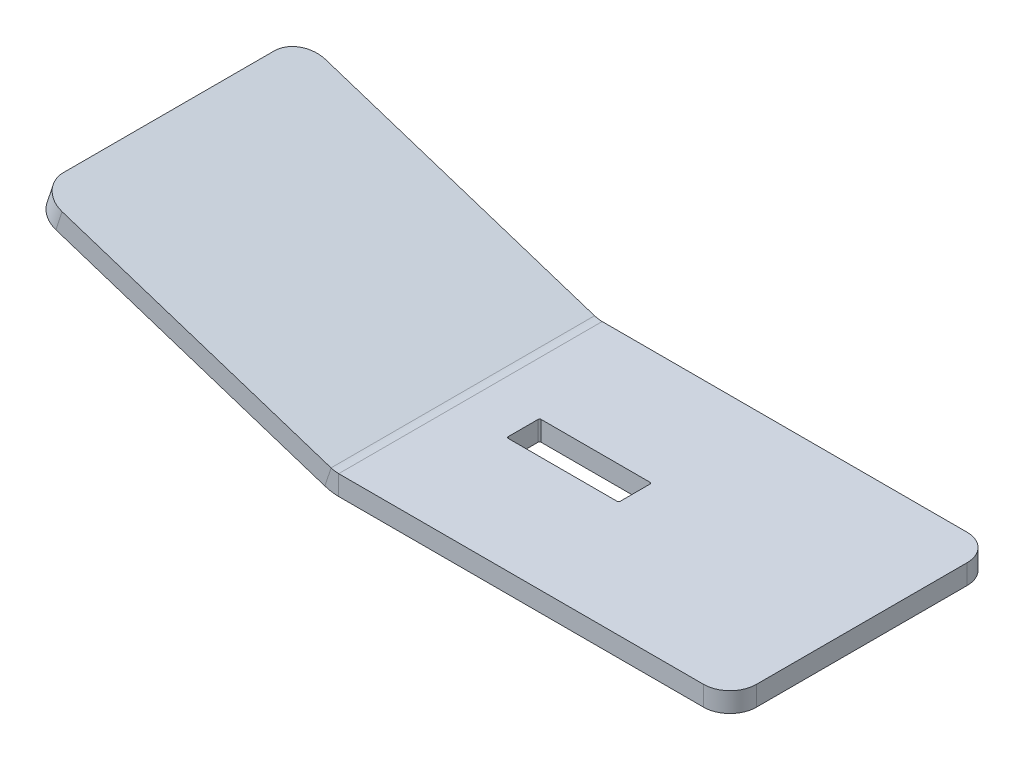
ISO-10303-21;
HEADER;
FILE_DESCRIPTION(('STEP AP214'),'2;1');
FILE_NAME('part.step','',(''),(''),'','','');
FILE_SCHEMA(('AUTOMOTIVE_DESIGN { 1 0 10303 214 1 1 1 1 }'));
ENDSEC;
DATA;
#1=APPLICATION_CONTEXT('core data for automotive mechanical design processes');
#2=APPLICATION_PROTOCOL_DEFINITION('international standard','automotive_design',2000,#1);
#3=PRODUCT_CONTEXT('',#1,'mechanical');
#4=PRODUCT('Part','Part','',(#3));
#5=PRODUCT_RELATED_PRODUCT_CATEGORY('part','',(#4));
#6=PRODUCT_DEFINITION_FORMATION('','',#4);
#7=PRODUCT_DEFINITION_CONTEXT('part definition',#1,'design');
#8=PRODUCT_DEFINITION('design','',#6,#7);
#9=PRODUCT_DEFINITION_SHAPE('','',#8);
#10=(LENGTH_UNIT() NAMED_UNIT(*) SI_UNIT(.MILLI.,.METRE.));
#11=(NAMED_UNIT(*) PLANE_ANGLE_UNIT() SI_UNIT($,.RADIAN.));
#12=(NAMED_UNIT(*) SI_UNIT($,.STERADIAN.) SOLID_ANGLE_UNIT());
#13=UNCERTAINTY_MEASURE_WITH_UNIT(LENGTH_MEASURE(1.E-05),#10,'distance_accuracy_value','');
#14=(GEOMETRIC_REPRESENTATION_CONTEXT(3) GLOBAL_UNCERTAINTY_ASSIGNED_CONTEXT((#13)) GLOBAL_UNIT_ASSIGNED_CONTEXT((#10,
#11,#12)) REPRESENTATION_CONTEXT('',''));
#15=CARTESIAN_POINT('',(0.,0.,0.));
#16=DIRECTION('',(0.,0.,1.));
#17=DIRECTION('',(1.,0.,0.));
#18=AXIS2_PLACEMENT_3D('',#15,#16,#17);
#19=CARTESIAN_POINT('',(0.,-4.7752,0.));
#20=DIRECTION('',(0.,0.,1.));
#21=DIRECTION('',(1.,0.,0.));
#22=AXIS2_PLACEMENT_3D('',#19,#20,#21);
#23=PLANE('',#22);
#24=DIRECTION('',(1.,0.,0.));
#25=VECTOR('',#24,1.);
#26=CARTESIAN_POINT('',(0.,-4.7752,0.));
#27=LINE('',#26,#25);
#28=CARTESIAN_POINT('',(0.941373759512896,-4.7752,0.));
#29=VERTEX_POINT('',#28);
#30=CARTESIAN_POINT('',(88.9,-4.7752,0.));
#31=VERTEX_POINT('',#30);
#32=EDGE_CURVE('E248',#29,#31,#27,.T.);
#33=ORIENTED_EDGE('',*,*,#32,.T.);
#34=DIRECTION('',(0.,1.,0.));
#35=VECTOR('',#34,1.);
#36=CARTESIAN_POINT('',(88.9,-4.7752,0.));
#37=LINE('',#36,#35);
#38=CARTESIAN_POINT('',(88.9,0.,0.));
#39=VERTEX_POINT('',#38);
#40=EDGE_CURVE('E278',#31,#39,#37,.T.);
#41=ORIENTED_EDGE('',*,*,#40,.T.);
#42=DIRECTION('',(1.,0.,0.));
#43=VECTOR('',#42,1.);
#44=CARTESIAN_POINT('',(0.,0.,0.));
#45=LINE('',#44,#43);
#46=CARTESIAN_POINT('',(0.941373759512895,0.,0.));
#47=VERTEX_POINT('',#46);
#48=EDGE_CURVE('E246',#47,#39,#45,.T.);
#49=ORIENTED_EDGE('',*,*,#48,.F.);
#50=DIRECTION('',(0.,-1.,0.));
#51=VECTOR('',#50,1.);
#52=CARTESIAN_POINT('',(0.941373759512895,0.,0.));
#53=LINE('',#52,#51);
#54=EDGE_CURVE('E235',#47,#29,#53,.T.);
#55=ORIENTED_EDGE('',*,*,#54,.T.);
#56=EDGE_LOOP('',(#33,#41,#49,#55));
#57=FACE_BOUND('',#56,.T.);
#58=ADVANCED_FACE('F45',(#57),#23,.T.);
#59=CARTESIAN_POINT('',(0.,-4.7752,0.));
#60=DIRECTION('',(0.,-1.,0.));
#61=DIRECTION('',(0.,0.,-1.));
#62=AXIS2_PLACEMENT_3D('',#59,#60,#61);
#63=PLANE('',#62);
#64=DIRECTION('',(-1.,0.,0.));
#65=VECTOR('',#64,1.);
#66=CARTESIAN_POINT('',(13.6413737595129,-4.7752,-35.71875));
#67=LINE('',#66,#65);
#68=CARTESIAN_POINT('',(40.2319987595129,-4.7752,-35.71875));
#69=VERTEX_POINT('',#68);
#70=CARTESIAN_POINT('',(14.0382487595129,-4.7752,-35.71875));
#71=VERTEX_POINT('',#70);
#72=EDGE_CURVE('E353',#69,#71,#67,.T.);
#73=ORIENTED_EDGE('',*,*,#72,.T.);
#74=CARTESIAN_POINT('',(14.0382487595129,-4.7752,-35.321875));
#75=DIRECTION('',(0.,-1.,0.));
#76=DIRECTION('',(0.,0.,-1.));
#77=AXIS2_PLACEMENT_3D('',#74,#75,#76);
#78=CIRCLE('',#77,0.396875);
#79=CARTESIAN_POINT('',(13.6413737595129,-4.7752,-35.321875));
#80=VERTEX_POINT('',#79);
#81=EDGE_CURVE('E323',#71,#80,#78,.F.);
#82=ORIENTED_EDGE('',*,*,#81,.T.);
#83=DIRECTION('',(0.,0.,1.));
#84=VECTOR('',#83,1.);
#85=CARTESIAN_POINT('',(13.6413737595129,-4.7752,-35.71875));
#86=LINE('',#85,#84);
#87=CARTESIAN_POINT('',(13.6413737595129,-4.7752,-28.178125));
#88=VERTEX_POINT('',#87);
#89=EDGE_CURVE('E357',#80,#88,#86,.T.);
#90=ORIENTED_EDGE('',*,*,#89,.T.);
#91=CARTESIAN_POINT('',(14.0382487595129,-4.7752,-28.178125));
#92=DIRECTION('',(0.,-1.,0.));
#93=DIRECTION('',(0.,0.,-1.));
#94=AXIS2_PLACEMENT_3D('',#91,#92,#93);
#95=CIRCLE('',#94,0.396875);
#96=CARTESIAN_POINT('',(14.0382487595129,-4.7752,-27.78125));
#97=VERTEX_POINT('',#96);
#98=EDGE_CURVE('E67',#88,#97,#95,.F.);
#99=ORIENTED_EDGE('',*,*,#98,.T.);
#100=DIRECTION('',(1.,0.,0.));
#101=VECTOR('',#100,1.);
#102=CARTESIAN_POINT('',(13.6413737595129,-4.7752,-27.78125));
#103=LINE('',#102,#101);
#104=CARTESIAN_POINT('',(40.2319987595129,-4.7752,-27.78125));
#105=VERTEX_POINT('',#104);
#106=EDGE_CURVE('E349',#97,#105,#103,.T.);
#107=ORIENTED_EDGE('',*,*,#106,.T.);
#108=CARTESIAN_POINT('',(40.2319987595129,-4.7752,-28.178125));
#109=DIRECTION('',(0.,-1.,0.));
#110=DIRECTION('',(0.,0.,-1.));
#111=AXIS2_PLACEMENT_3D('',#108,#109,#110);
#112=CIRCLE('',#111,0.396875);
#113=CARTESIAN_POINT('',(40.6288737595129,-4.7752,-28.178125));
#114=VERTEX_POINT('',#113);
#115=EDGE_CURVE('E11',#105,#114,#112,.F.);
#116=ORIENTED_EDGE('',*,*,#115,.T.);
#117=DIRECTION('',(0.,0.,-1.));
#118=VECTOR('',#117,1.);
#119=CARTESIAN_POINT('',(40.6288737595129,-4.7752,-35.71875));
#120=LINE('',#119,#118);
#121=CARTESIAN_POINT('',(40.6288737595129,-4.7752,-35.321875));
#122=VERTEX_POINT('',#121);
#123=EDGE_CURVE('E347',#114,#122,#120,.T.);
#124=ORIENTED_EDGE('',*,*,#123,.T.);
#125=CARTESIAN_POINT('',(40.2319987595129,-4.7752,-35.321875));
#126=DIRECTION('',(0.,-1.,0.));
#127=DIRECTION('',(0.,0.,-1.));
#128=AXIS2_PLACEMENT_3D('',#125,#126,#127);
#129=CIRCLE('',#128,0.396875);
#130=EDGE_CURVE('E319',#122,#69,#129,.F.);
#131=ORIENTED_EDGE('',*,*,#130,.T.);
#132=EDGE_LOOP('',(#73,#82,#90,#99,#107,#116,#124,#131));
#133=FACE_BOUND('',#132,.T.);
#134=DIRECTION('',(-1.,0.,0.));
#135=VECTOR('',#134,1.);
#136=CARTESIAN_POINT('',(0.,-4.7752,-63.5));
#137=LINE('',#136,#135);
#138=CARTESIAN_POINT('',(88.9,-4.7752,-63.5));
#139=VERTEX_POINT('',#138);
#140=CARTESIAN_POINT('',(0.941373759512895,-4.7752,-63.5));
#141=VERTEX_POINT('',#140);
#142=EDGE_CURVE('E255',#139,#141,#137,.T.);
#143=ORIENTED_EDGE('',*,*,#142,.F.);
#144=CARTESIAN_POINT('',(88.9,-4.7752,-57.15));
#145=DIRECTION('',(0.,-1.,0.));
#146=DIRECTION('',(0.,0.,-1.));
#147=AXIS2_PLACEMENT_3D('',#144,#145,#146);
#148=CIRCLE('',#147,6.35);
#149=CARTESIAN_POINT('',(95.25,-4.7752,-57.15));
#150=VERTEX_POINT('',#149);
#151=EDGE_CURVE('E276',#139,#150,#148,.T.);
#152=ORIENTED_EDGE('',*,*,#151,.T.);
#153=DIRECTION('',(0.,0.,-1.));
#154=VECTOR('',#153,1.);
#155=CARTESIAN_POINT('',(95.25,-4.7752,0.));
#156=LINE('',#155,#154);
#157=CARTESIAN_POINT('',(95.25,-4.7752,-6.35));
#158=VERTEX_POINT('',#157);
#159=EDGE_CURVE('E251',#158,#150,#156,.T.);
#160=ORIENTED_EDGE('',*,*,#159,.F.);
#161=CARTESIAN_POINT('',(88.9,-4.7752,-6.35));
#162=DIRECTION('',(0.,-1.,0.));
#163=DIRECTION('',(0.,0.,-1.));
#164=AXIS2_PLACEMENT_3D('',#161,#162,#163);
#165=CIRCLE('',#164,6.35);
#166=EDGE_CURVE('E274',#158,#31,#165,.T.);
#167=ORIENTED_EDGE('',*,*,#166,.T.);
#168=ORIENTED_EDGE('',*,*,#32,.F.);
#169=DIRECTION('',(0.,0.,1.));
#170=VECTOR('',#169,1.);
#171=CARTESIAN_POINT('',(0.941373759512896,-4.7752,0.));
#172=LINE('',#171,#170);
#173=EDGE_CURVE('E191',#29,#141,#172,.F.);
#174=ORIENTED_EDGE('',*,*,#173,.T.);
#175=EDGE_LOOP('',(#143,#152,#160,#167,#168,#174));
#176=FACE_BOUND('',#175,.T.);
#177=ADVANCED_FACE('F345',(#133,#176),#63,.T.);
#178=CARTESIAN_POINT('',(0.,0.,0.));
#179=DIRECTION('',(0.,-1.,0.));
#180=DIRECTION('',(0.,0.,-1.));
#181=AXIS2_PLACEMENT_3D('',#178,#179,#180);
#182=PLANE('',#181);
#183=DIRECTION('',(1.,0.,0.));
#184=VECTOR('',#183,1.);
#185=CARTESIAN_POINT('',(13.6413737595129,0.,-27.78125));
#186=LINE('',#185,#184);
#187=CARTESIAN_POINT('',(14.0382487595129,0.,-27.78125));
#188=VERTEX_POINT('',#187);
#189=CARTESIAN_POINT('',(40.2319987595129,0.,-27.78125));
#190=VERTEX_POINT('',#189);
#191=EDGE_CURVE('E332',#188,#190,#186,.T.);
#192=ORIENTED_EDGE('',*,*,#191,.F.);
#193=CARTESIAN_POINT('',(14.0382487595129,0.,-28.178125));
#194=DIRECTION('',(0.,-1.,0.));
#195=DIRECTION('',(0.,0.,-1.));
#196=AXIS2_PLACEMENT_3D('',#193,#194,#195);
#197=CIRCLE('',#196,0.396875);
#198=CARTESIAN_POINT('',(13.6413737595129,0.,-28.178125));
#199=VERTEX_POINT('',#198);
#200=EDGE_CURVE('E325',#188,#199,#197,.T.);
#201=ORIENTED_EDGE('',*,*,#200,.T.);
#202=DIRECTION('',(0.,0.,1.));
#203=VECTOR('',#202,1.);
#204=CARTESIAN_POINT('',(13.6413737595129,0.,-35.71875));
#205=LINE('',#204,#203);
#206=CARTESIAN_POINT('',(13.6413737595129,0.,-35.321875));
#207=VERTEX_POINT('',#206);
#208=EDGE_CURVE('E339',#207,#199,#205,.T.);
#209=ORIENTED_EDGE('',*,*,#208,.F.);
#210=CARTESIAN_POINT('',(14.0382487595129,0.,-35.321875));
#211=DIRECTION('',(0.,-1.,0.));
#212=DIRECTION('',(0.,0.,-1.));
#213=AXIS2_PLACEMENT_3D('',#210,#211,#212);
#214=CIRCLE('',#213,0.396875);
#215=CARTESIAN_POINT('',(14.0382487595129,0.,-35.71875));
#216=VERTEX_POINT('',#215);
#217=EDGE_CURVE('E321',#207,#216,#214,.T.);
#218=ORIENTED_EDGE('',*,*,#217,.T.);
#219=DIRECTION('',(-1.,0.,0.));
#220=VECTOR('',#219,1.);
#221=CARTESIAN_POINT('',(13.6413737595129,0.,-35.71875));
#222=LINE('',#221,#220);
#223=CARTESIAN_POINT('',(40.2319987595129,0.,-35.71875));
#224=VERTEX_POINT('',#223);
#225=EDGE_CURVE('E364',#224,#216,#222,.T.);
#226=ORIENTED_EDGE('',*,*,#225,.F.);
#227=CARTESIAN_POINT('',(40.2319987595129,0.,-35.321875));
#228=DIRECTION('',(0.,-1.,0.));
#229=DIRECTION('',(0.,0.,-1.));
#230=AXIS2_PLACEMENT_3D('',#227,#228,#229);
#231=CIRCLE('',#230,0.396875);
#232=CARTESIAN_POINT('',(40.6288737595129,0.,-35.321875));
#233=VERTEX_POINT('',#232);
#234=EDGE_CURVE('E317',#224,#233,#231,.T.);
#235=ORIENTED_EDGE('',*,*,#234,.T.);
#236=DIRECTION('',(0.,0.,-1.));
#237=VECTOR('',#236,1.);
#238=CARTESIAN_POINT('',(40.6288737595129,0.,-35.71875));
#239=LINE('',#238,#237);
#240=CARTESIAN_POINT('',(40.6288737595129,0.,-28.178125));
#241=VERTEX_POINT('',#240);
#242=EDGE_CURVE('E334',#241,#233,#239,.T.);
#243=ORIENTED_EDGE('',*,*,#242,.F.);
#244=CARTESIAN_POINT('',(40.2319987595129,0.,-28.178125));
#245=DIRECTION('',(0.,-1.,0.));
#246=DIRECTION('',(0.,0.,-1.));
#247=AXIS2_PLACEMENT_3D('',#244,#245,#246);
#248=CIRCLE('',#247,0.396875);
#249=EDGE_CURVE('E53',#241,#190,#248,.T.);
#250=ORIENTED_EDGE('',*,*,#249,.T.);
#251=EDGE_LOOP('',(#192,#201,#209,#218,#226,#235,#243,#250));
#252=FACE_BOUND('',#251,.T.);
#253=DIRECTION('',(0.,0.,-1.));
#254=VECTOR('',#253,1.);
#255=CARTESIAN_POINT('',(95.25,0.,0.));
#256=LINE('',#255,#254);
#257=CARTESIAN_POINT('',(95.25,0.,-6.35));
#258=VERTEX_POINT('',#257);
#259=CARTESIAN_POINT('',(95.25,0.,-57.15));
#260=VERTEX_POINT('',#259);
#261=EDGE_CURVE('E260',#258,#260,#256,.T.);
#262=ORIENTED_EDGE('',*,*,#261,.T.);
#263=CARTESIAN_POINT('',(88.9,0.,-57.15));
#264=DIRECTION('',(0.,-1.,0.));
#265=DIRECTION('',(0.,0.,-1.));
#266=AXIS2_PLACEMENT_3D('',#263,#264,#265);
#267=CIRCLE('',#266,6.35);
#268=CARTESIAN_POINT('',(88.9,0.,-63.5));
#269=VERTEX_POINT('',#268);
#270=EDGE_CURVE('E270',#260,#269,#267,.F.);
#271=ORIENTED_EDGE('',*,*,#270,.T.);
#272=DIRECTION('',(-1.,0.,0.));
#273=VECTOR('',#272,1.);
#274=CARTESIAN_POINT('',(0.,0.,-63.5));
#275=LINE('',#274,#273);
#276=CARTESIAN_POINT('',(0.941373759512895,0.,-63.5));
#277=VERTEX_POINT('',#276);
#278=EDGE_CURVE('E252',#269,#277,#275,.T.);
#279=ORIENTED_EDGE('',*,*,#278,.T.);
#280=DIRECTION('',(0.,0.,1.));
#281=VECTOR('',#280,1.);
#282=CARTESIAN_POINT('',(0.941373759512895,0.,0.));
#283=LINE('',#282,#281);
#284=EDGE_CURVE('E239',#47,#277,#283,.F.);
#285=ORIENTED_EDGE('',*,*,#284,.F.);
#286=ORIENTED_EDGE('',*,*,#48,.T.);
#287=CARTESIAN_POINT('',(88.9,0.,-6.35));
#288=DIRECTION('',(0.,-1.,0.));
#289=DIRECTION('',(0.,0.,-1.));
#290=AXIS2_PLACEMENT_3D('',#287,#288,#289);
#291=CIRCLE('',#290,6.35);
#292=EDGE_CURVE('E268',#39,#258,#291,.F.);
#293=ORIENTED_EDGE('',*,*,#292,.T.);
#294=EDGE_LOOP('',(#262,#271,#279,#285,#286,#293));
#295=FACE_BOUND('',#294,.T.);
#296=ADVANCED_FACE('F330',(#252,#295),#182,.F.);
#297=CARTESIAN_POINT('',(0.,-4.7752,-63.5));
#298=DIRECTION('',(0.,0.,-1.));
#299=DIRECTION('',(-1.,0.,0.));
#300=AXIS2_PLACEMENT_3D('',#297,#298,#299);
#301=PLANE('',#300);
#302=ORIENTED_EDGE('',*,*,#278,.F.);
#303=DIRECTION('',(0.,1.,0.));
#304=VECTOR('',#303,1.);
#305=CARTESIAN_POINT('',(88.9,-4.7752,-63.5));
#306=LINE('',#305,#304);
#307=EDGE_CURVE('E272',#269,#139,#306,.F.);
#308=ORIENTED_EDGE('',*,*,#307,.T.);
#309=ORIENTED_EDGE('',*,*,#142,.T.);
#310=DIRECTION('',(0.,-1.,0.));
#311=VECTOR('',#310,1.);
#312=CARTESIAN_POINT('',(0.941373759512895,0.,-63.5));
#313=LINE('',#312,#311);
#314=EDGE_CURVE('E243',#277,#141,#313,.T.);
#315=ORIENTED_EDGE('',*,*,#314,.F.);
#316=EDGE_LOOP('',(#302,#308,#309,#315));
#317=FACE_BOUND('',#316,.T.);
#318=ADVANCED_FACE('F439',(#317),#301,.T.);
#319=CARTESIAN_POINT('',(95.25,-4.7752,0.));
#320=DIRECTION('',(1.,0.,0.));
#321=DIRECTION('',(0.,0.,-1.));
#322=AXIS2_PLACEMENT_3D('',#319,#320,#321);
#323=PLANE('',#322);
#324=ORIENTED_EDGE('',*,*,#159,.T.);
#325=DIRECTION('',(0.,1.,0.));
#326=VECTOR('',#325,1.);
#327=CARTESIAN_POINT('',(95.25,-4.7752,-57.15));
#328=LINE('',#327,#326);
#329=EDGE_CURVE('E265',#150,#260,#328,.T.);
#330=ORIENTED_EDGE('',*,*,#329,.T.);
#331=ORIENTED_EDGE('',*,*,#261,.F.);
#332=DIRECTION('',(0.,1.,0.));
#333=VECTOR('',#332,1.);
#334=CARTESIAN_POINT('',(95.25,-4.7752,-6.35));
#335=LINE('',#334,#333);
#336=EDGE_CURVE('E257',#258,#158,#335,.F.);
#337=ORIENTED_EDGE('',*,*,#336,.T.);
#338=EDGE_LOOP('',(#324,#330,#331,#337));
#339=FACE_BOUND('',#338,.T.);
#340=ADVANCED_FACE('F417',(#339),#323,.T.);
#341=CARTESIAN_POINT('',(0.941373759512895,5.9436,-63.5));
#342=DIRECTION('',(0.,0.,-1.));
#343=DIRECTION('',(0.,1.,0.));
#344=AXIS2_PLACEMENT_3D('',#341,#342,#343);
#345=PLANE('',#344);
#346=DIRECTION('',(-0.309016994374942,-0.951056516295155,0.));
#347=VECTOR('',#346,1.);
#348=CARTESIAN_POINT('',(-0.895299648254008,0.290900489748114,-63.5));
#349=LINE('',#348,#347);
#350=CARTESIAN_POINT('',(-0.895299648254009,0.290900489748115,-63.5));
#351=VERTEX_POINT('',#350);
#352=CARTESIAN_POINT('',(-2.37091759979323,-4.25058458686451,-63.5));
#353=VERTEX_POINT('',#352);
#354=EDGE_CURVE('E355',#351,#353,#349,.T.);
#355=ORIENTED_EDGE('',*,*,#354,.F.);
#356=CARTESIAN_POINT('',(0.941373759512895,5.9436,-63.5));
#357=DIRECTION('',(0.,0.,1.));
#358=DIRECTION('',(0.,-1.,0.));
#359=AXIS2_PLACEMENT_3D('',#356,#357,#358);
#360=CIRCLE('',#359,5.9436);
#361=EDGE_CURVE('E194',#277,#351,#360,.F.);
#362=ORIENTED_EDGE('',*,*,#361,.F.);
#363=ORIENTED_EDGE('',*,*,#314,.T.);
#364=CARTESIAN_POINT('',(0.941373759512895,5.9436,-63.5));
#365=DIRECTION('',(0.,0.,1.));
#366=DIRECTION('',(0.,-1.,0.));
#367=AXIS2_PLACEMENT_3D('',#364,#365,#366);
#368=CIRCLE('',#367,10.7188);
#369=EDGE_CURVE('E234',#141,#353,#368,.F.);
#370=ORIENTED_EDGE('',*,*,#369,.T.);
#371=EDGE_LOOP('',(#355,#362,#363,#370));
#372=FACE_BOUND('',#371,.T.);
#373=ADVANCED_FACE('F375',(#372),#345,.T.);
#374=CARTESIAN_POINT('',(0.941373759512895,5.9436,0.));
#375=DIRECTION('',(0.,0.,-1.));
#376=DIRECTION('',(0.,1.,0.));
#377=AXIS2_PLACEMENT_3D('',#374,#375,#376);
#378=PLANE('',#377);
#379=CARTESIAN_POINT('',(0.941373759512895,5.9436,0.));
#380=DIRECTION('',(0.,0.,1.));
#381=DIRECTION('',(0.,-1.,0.));
#382=AXIS2_PLACEMENT_3D('',#379,#380,#381);
#383=CIRCLE('',#382,5.9436);
#384=CARTESIAN_POINT('',(-0.895299648254009,0.29090048974811,0.));
#385=VERTEX_POINT('',#384);
#386=EDGE_CURVE('E201',#385,#47,#383,.T.);
#387=ORIENTED_EDGE('',*,*,#386,.F.);
#388=DIRECTION('',(-0.309016994374942,-0.951056516295155,0.));
#389=VECTOR('',#388,1.);
#390=CARTESIAN_POINT('',(-0.895299648254008,0.290900489748114,0.));
#391=LINE('',#390,#389);
#392=CARTESIAN_POINT('',(-2.37091759979323,-4.25058458686451,0.));
#393=VERTEX_POINT('',#392);
#394=EDGE_CURVE('E198',#385,#393,#391,.T.);
#395=ORIENTED_EDGE('',*,*,#394,.T.);
#396=CARTESIAN_POINT('',(0.941373759512895,5.9436,0.));
#397=DIRECTION('',(0.,0.,1.));
#398=DIRECTION('',(0.,-1.,0.));
#399=AXIS2_PLACEMENT_3D('',#396,#397,#398);
#400=CIRCLE('',#399,10.7188);
#401=EDGE_CURVE('E183',#393,#29,#400,.T.);
#402=ORIENTED_EDGE('',*,*,#401,.T.);
#403=ORIENTED_EDGE('',*,*,#54,.F.);
#404=EDGE_LOOP('',(#387,#395,#402,#403));
#405=FACE_BOUND('',#404,.T.);
#406=ADVANCED_FACE('F199',(#405),#378,.F.);
#407=CARTESIAN_POINT('',(0.941373759512895,5.9436,0.));
#408=DIRECTION('',(0.,0.,1.));
#409=DIRECTION('',(-0.309016994374942,-0.951056516295155,0.));
#410=AXIS2_PLACEMENT_3D('',#407,#408,#409);
#411=CYLINDRICAL_SURFACE('',#410,10.7188);
#412=ORIENTED_EDGE('',*,*,#173,.F.);
#413=ORIENTED_EDGE('',*,*,#401,.F.);
#414=DIRECTION('',(0.,0.,-1.));
#415=VECTOR('',#414,1.);
#416=CARTESIAN_POINT('',(-2.37091759979323,-4.25058458686451,0.));
#417=LINE('',#416,#415);
#418=EDGE_CURVE('E188',#393,#353,#417,.T.);
#419=ORIENTED_EDGE('',*,*,#418,.T.);
#420=ORIENTED_EDGE('',*,*,#369,.F.);
#421=EDGE_LOOP('',(#412,#413,#419,#420));
#422=FACE_BOUND('',#421,.T.);
#423=ADVANCED_FACE('F185',(#422),#411,.T.);
#424=CARTESIAN_POINT('',(0.941373759512895,5.9436,0.));
#425=DIRECTION('',(0.,0.,1.));
#426=DIRECTION('',(-0.309016994374942,-0.951056516295155,0.));
#427=AXIS2_PLACEMENT_3D('',#424,#425,#426);
#428=CYLINDRICAL_SURFACE('',#427,5.9436);
#429=ORIENTED_EDGE('',*,*,#284,.T.);
#430=ORIENTED_EDGE('',*,*,#361,.T.);
#431=DIRECTION('',(0.,0.,1.));
#432=VECTOR('',#431,1.);
#433=CARTESIAN_POINT('',(-0.895299648254008,0.290900489748114,-63.5));
#434=LINE('',#433,#432);
#435=EDGE_CURVE('E206',#351,#385,#434,.T.);
#436=ORIENTED_EDGE('',*,*,#435,.T.);
#437=ORIENTED_EDGE('',*,*,#386,.T.);
#438=EDGE_LOOP('',(#429,#430,#436,#437));
#439=FACE_BOUND('',#438,.T.);
#440=ADVANCED_FACE('F379',(#439),#428,.F.);
#441=CARTESIAN_POINT('',(-73.2268239211286,18.7718949713705,0.));
#442=DIRECTION('',(0.,0.,-1.));
#443=DIRECTION('',(-1.,0.,0.));
#444=AXIS2_PLACEMENT_3D('',#441,#442,#443);
#445=PLANE('',#444);
#446=DIRECTION('',(-0.951056516295155,0.309016994374942,0.));
#447=VECTOR('',#446,1.);
#448=CARTESIAN_POINT('',(-71.7512059695893,23.3133800479832,0.));
#449=LINE('',#448,#447);
#450=CARTESIAN_POINT('',(-65.7119970911151,21.3511221337023,0.));
#451=VERTEX_POINT('',#450);
#452=EDGE_CURVE('E216',#385,#451,#449,.T.);
#453=ORIENTED_EDGE('',*,*,#452,.T.);
#454=DIRECTION('',(0.309016994374942,0.951056516295155,0.));
#455=VECTOR('',#454,1.);
#456=CARTESIAN_POINT('',(-67.1876150426543,16.8096370570897,0.));
#457=LINE('',#456,#455);
#458=CARTESIAN_POINT('',(-67.1876150426543,16.8096370570897,0.));
#459=VERTEX_POINT('',#458);
#460=EDGE_CURVE('E220',#451,#459,#457,.F.);
#461=ORIENTED_EDGE('',*,*,#460,.T.);
#462=DIRECTION('',(-0.951056516295155,0.309016994374942,0.));
#463=VECTOR('',#462,1.);
#464=CARTESIAN_POINT('',(-73.2268239211286,18.7718949713705,0.));
#465=LINE('',#464,#463);
#466=EDGE_CURVE('E212',#393,#459,#465,.T.);
#467=ORIENTED_EDGE('',*,*,#466,.F.);
#468=ORIENTED_EDGE('',*,*,#394,.F.);
#469=EDGE_LOOP('',(#453,#461,#467,#468));
#470=FACE_BOUND('',#469,.T.);
#471=ADVANCED_FACE('F218',(#470),#445,.F.);
#472=CARTESIAN_POINT('',(-1.47561795153922,-4.54148507661263,-63.5));
#473=DIRECTION('',(0.,0.,1.));
#474=DIRECTION('',(1.,0.,0.));
#475=AXIS2_PLACEMENT_3D('',#472,#473,#474);
#476=PLANE('',#475);
#477=DIRECTION('',(0.951056516295155,-0.309016994374942,0.));
#478=VECTOR('',#477,1.);
#479=CARTESIAN_POINT('',(-1.47561795153922,-4.54148507661263,-63.5));
#480=LINE('',#479,#478);
#481=CARTESIAN_POINT('',(-67.1876150426543,16.8096370570897,-63.5));
#482=VERTEX_POINT('',#481);
#483=EDGE_CURVE('E215',#482,#353,#480,.T.);
#484=ORIENTED_EDGE('',*,*,#483,.F.);
#485=DIRECTION('',(0.309016994374942,0.951056516295155,0.));
#486=VECTOR('',#485,1.);
#487=CARTESIAN_POINT('',(-67.1876150426543,16.8096370570897,-63.5));
#488=LINE('',#487,#486);
#489=CARTESIAN_POINT('',(-65.7119970911151,21.3511221337023,-63.5));
#490=VERTEX_POINT('',#489);
#491=EDGE_CURVE('E281',#482,#490,#488,.T.);
#492=ORIENTED_EDGE('',*,*,#491,.T.);
#493=DIRECTION('',(0.951056516295155,-0.309016994374942,0.));
#494=VECTOR('',#493,1.);
#495=CARTESIAN_POINT('',(0.,0.,-63.5));
#496=LINE('',#495,#494);
#497=EDGE_CURVE('E222',#490,#351,#496,.T.);
#498=ORIENTED_EDGE('',*,*,#497,.T.);
#499=ORIENTED_EDGE('',*,*,#354,.T.);
#500=EDGE_LOOP('',(#484,#492,#498,#499));
#501=FACE_BOUND('',#500,.T.);
#502=ADVANCED_FACE('F370',(#501),#476,.F.);
#503=CARTESIAN_POINT('',(-1.47561795153922,-4.54148507661262,0.));
#504=DIRECTION('',(0.309016994374942,0.951056516295155,0.));
#505=DIRECTION('',(-0.951056516295155,0.309016994374942,0.));
#506=AXIS2_PLACEMENT_3D('',#503,#504,#505);
#507=PLANE('',#506);
#508=DIRECTION('',(0.,0.,-1.));
#509=VECTOR('',#508,1.);
#510=CARTESIAN_POINT('',(-73.2268239211286,18.7718949713705,-63.5));
#511=LINE('',#510,#509);
#512=CARTESIAN_POINT('',(-73.2268239211286,18.7718949713705,-6.35));
#513=VERTEX_POINT('',#512);
#514=CARTESIAN_POINT('',(-73.2268239211286,18.7718949713705,-57.15));
#515=VERTEX_POINT('',#514);
#516=EDGE_CURVE('E221',#513,#515,#511,.T.);
#517=ORIENTED_EDGE('',*,*,#516,.T.);
#518=CARTESIAN_POINT('',(-67.1876150426543,16.8096370570897,-57.15));
#519=DIRECTION('',(0.309016994374942,0.951056516295155,0.));
#520=DIRECTION('',(-0.951056516295155,0.309016994374942,0.));
#521=AXIS2_PLACEMENT_3D('',#518,#519,#520);
#522=CIRCLE('',#521,6.35);
#523=EDGE_CURVE('E295',#515,#482,#522,.F.);
#524=ORIENTED_EDGE('',*,*,#523,.T.);
#525=ORIENTED_EDGE('',*,*,#483,.T.);
#526=ORIENTED_EDGE('',*,*,#418,.F.);
#527=ORIENTED_EDGE('',*,*,#466,.T.);
#528=CARTESIAN_POINT('',(-67.1876150426543,16.8096370570897,-6.35));
#529=DIRECTION('',(0.309016994374942,0.951056516295155,0.));
#530=DIRECTION('',(-0.951056516295155,0.309016994374942,0.));
#531=AXIS2_PLACEMENT_3D('',#528,#529,#530);
#532=CIRCLE('',#531,6.35);
#533=EDGE_CURVE('E293',#459,#513,#532,.F.);
#534=ORIENTED_EDGE('',*,*,#533,.T.);
#535=EDGE_LOOP('',(#517,#524,#525,#526,#527,#534));
#536=FACE_BOUND('',#535,.T.);
#537=ADVANCED_FACE('F211',(#536),#507,.F.);
#538=CARTESIAN_POINT('',(0.,0.,0.));
#539=DIRECTION('',(0.309016994374942,0.951056516295155,0.));
#540=DIRECTION('',(-0.951056516295155,0.309016994374942,0.));
#541=AXIS2_PLACEMENT_3D('',#538,#539,#540);
#542=PLANE('',#541);
#543=ORIENTED_EDGE('',*,*,#497,.F.);
#544=CARTESIAN_POINT('',(-65.7119970911151,21.3511221337023,-57.15));
#545=DIRECTION('',(0.309016994374942,0.951056516295155,0.));
#546=DIRECTION('',(-0.951056516295155,0.309016994374942,0.));
#547=AXIS2_PLACEMENT_3D('',#544,#545,#546);
#548=CIRCLE('',#547,6.35);
#549=CARTESIAN_POINT('',(-71.7512059695893,23.3133800479832,-57.15));
#550=VERTEX_POINT('',#549);
#551=EDGE_CURVE('E286',#490,#550,#548,.T.);
#552=ORIENTED_EDGE('',*,*,#551,.T.);
#553=DIRECTION('',(0.,0.,-1.));
#554=VECTOR('',#553,1.);
#555=CARTESIAN_POINT('',(-71.7512059695893,23.3133800479832,-63.5));
#556=LINE('',#555,#554);
#557=CARTESIAN_POINT('',(-71.7512059695893,23.3133800479832,-6.35));
#558=VERTEX_POINT('',#557);
#559=EDGE_CURVE('E225',#558,#550,#556,.T.);
#560=ORIENTED_EDGE('',*,*,#559,.F.);
#561=CARTESIAN_POINT('',(-65.7119970911151,21.3511221337023,-6.35));
#562=DIRECTION('',(0.309016994374942,0.951056516295155,0.));
#563=DIRECTION('',(-0.951056516295155,0.309016994374942,0.));
#564=AXIS2_PLACEMENT_3D('',#561,#562,#563);
#565=CIRCLE('',#564,6.35);
#566=EDGE_CURVE('E284',#558,#451,#565,.T.);
#567=ORIENTED_EDGE('',*,*,#566,.T.);
#568=ORIENTED_EDGE('',*,*,#452,.F.);
#569=ORIENTED_EDGE('',*,*,#435,.F.);
#570=EDGE_LOOP('',(#543,#552,#560,#567,#568,#569));
#571=FACE_BOUND('',#570,.T.);
#572=ADVANCED_FACE('F382',(#571),#542,.T.);
#573=CARTESIAN_POINT('',(-73.2268239211286,18.7718949713705,-63.5));
#574=DIRECTION('',(0.951056516295155,-0.309016994374942,0.));
#575=DIRECTION('',(0.309016994374942,0.951056516295155,0.));
#576=AXIS2_PLACEMENT_3D('',#573,#574,#575);
#577=PLANE('',#576);
#578=ORIENTED_EDGE('',*,*,#559,.T.);
#579=DIRECTION('',(0.309016994374942,0.951056516295155,0.));
#580=VECTOR('',#579,1.);
#581=CARTESIAN_POINT('',(-73.2268239211286,18.7718949713705,-57.15));
#582=LINE('',#581,#580);
#583=EDGE_CURVE('E291',#550,#515,#582,.F.);
#584=ORIENTED_EDGE('',*,*,#583,.T.);
#585=ORIENTED_EDGE('',*,*,#516,.F.);
#586=DIRECTION('',(0.309016994374942,0.951056516295155,0.));
#587=VECTOR('',#586,1.);
#588=CARTESIAN_POINT('',(-73.2268239211286,18.7718949713705,-6.35));
#589=LINE('',#588,#587);
#590=EDGE_CURVE('E288',#513,#558,#589,.T.);
#591=ORIENTED_EDGE('',*,*,#590,.T.);
#592=EDGE_LOOP('',(#578,#584,#585,#591));
#593=FACE_BOUND('',#592,.T.);
#594=ADVANCED_FACE('F390',(#593),#577,.F.);
#595=CARTESIAN_POINT('',(88.9,-4.7752,-57.15));
#596=DIRECTION('',(0.,1.,0.));
#597=DIRECTION('',(0.,0.,1.));
#598=AXIS2_PLACEMENT_3D('',#595,#596,#597);
#599=CYLINDRICAL_SURFACE('',#598,6.35);
#600=ORIENTED_EDGE('',*,*,#151,.F.);
#601=ORIENTED_EDGE('',*,*,#307,.F.);
#602=ORIENTED_EDGE('',*,*,#270,.F.);
#603=ORIENTED_EDGE('',*,*,#329,.F.);
#604=EDGE_LOOP('',(#600,#601,#602,#603));
#605=FACE_BOUND('',#604,.T.);
#606=ADVANCED_FACE('F403',(#605),#599,.T.);
#607=CARTESIAN_POINT('',(88.9,-4.7752,-6.35));
#608=DIRECTION('',(0.,1.,0.));
#609=DIRECTION('',(0.,0.,1.));
#610=AXIS2_PLACEMENT_3D('',#607,#608,#609);
#611=CYLINDRICAL_SURFACE('',#610,6.35);
#612=ORIENTED_EDGE('',*,*,#166,.F.);
#613=ORIENTED_EDGE('',*,*,#336,.F.);
#614=ORIENTED_EDGE('',*,*,#292,.F.);
#615=ORIENTED_EDGE('',*,*,#40,.F.);
#616=EDGE_LOOP('',(#612,#613,#614,#615));
#617=FACE_BOUND('',#616,.T.);
#618=ADVANCED_FACE('F395',(#617),#611,.T.);
#619=CARTESIAN_POINT('',(-67.1876150426543,16.8096370570897,-57.15));
#620=DIRECTION('',(0.309016994374942,0.951056516295155,0.));
#621=DIRECTION('',(-0.951056516295155,0.309016994374942,0.));
#622=AXIS2_PLACEMENT_3D('',#619,#620,#621);
#623=CYLINDRICAL_SURFACE('',#622,6.35);
#624=ORIENTED_EDGE('',*,*,#523,.F.);
#625=ORIENTED_EDGE('',*,*,#583,.F.);
#626=ORIENTED_EDGE('',*,*,#551,.F.);
#627=ORIENTED_EDGE('',*,*,#491,.F.);
#628=EDGE_LOOP('',(#624,#625,#626,#627));
#629=FACE_BOUND('',#628,.T.);
#630=ADVANCED_FACE('F393',(#629),#623,.T.);
#631=CARTESIAN_POINT('',(-67.1876150426543,16.8096370570897,-6.35));
#632=DIRECTION('',(0.309016994374942,0.951056516295155,0.));
#633=DIRECTION('',(-0.951056516295155,0.309016994374942,0.));
#634=AXIS2_PLACEMENT_3D('',#631,#632,#633);
#635=CYLINDRICAL_SURFACE('',#634,6.35);
#636=ORIENTED_EDGE('',*,*,#533,.F.);
#637=ORIENTED_EDGE('',*,*,#460,.F.);
#638=ORIENTED_EDGE('',*,*,#566,.F.);
#639=ORIENTED_EDGE('',*,*,#590,.F.);
#640=EDGE_LOOP('',(#636,#637,#638,#639));
#641=FACE_BOUND('',#640,.T.);
#642=ADVANCED_FACE('F385',(#641),#635,.T.);
#643=CARTESIAN_POINT('',(13.6413737595129,-4.7752,-35.71875));
#644=DIRECTION('',(-1.,0.,0.));
#645=DIRECTION('',(0.,0.,1.));
#646=AXIS2_PLACEMENT_3D('',#643,#644,#645);
#647=PLANE('',#646);
#648=ORIENTED_EDGE('',*,*,#89,.F.);
#649=DIRECTION('',(0.,1.,0.));
#650=VECTOR('',#649,1.);
#651=CARTESIAN_POINT('',(13.6413737595129,0.,-35.321875));
#652=LINE('',#651,#650);
#653=EDGE_CURVE('E310',#80,#207,#652,.T.);
#654=ORIENTED_EDGE('',*,*,#653,.T.);
#655=ORIENTED_EDGE('',*,*,#208,.T.);
#656=DIRECTION('',(0.,1.,0.));
#657=VECTOR('',#656,1.);
#658=CARTESIAN_POINT('',(13.6413737595129,-4.7752,-28.178125));
#659=LINE('',#658,#657);
#660=EDGE_CURVE('E308',#199,#88,#659,.F.);
#661=ORIENTED_EDGE('',*,*,#660,.T.);
#662=EDGE_LOOP('',(#648,#654,#655,#661));
#663=FACE_BOUND('',#662,.T.);
#664=ADVANCED_FACE('F401',(#663),#647,.F.);
#665=CARTESIAN_POINT('',(13.6413737595129,-4.7752,-35.71875));
#666=DIRECTION('',(0.,0.,-1.));
#667=DIRECTION('',(-1.,0.,0.));
#668=AXIS2_PLACEMENT_3D('',#665,#666,#667);
#669=PLANE('',#668);
#670=ORIENTED_EDGE('',*,*,#72,.F.);
#671=DIRECTION('',(0.,1.,0.));
#672=VECTOR('',#671,1.);
#673=CARTESIAN_POINT('',(40.2319987595129,0.,-35.71875));
#674=LINE('',#673,#672);
#675=EDGE_CURVE('E300',#69,#224,#674,.T.);
#676=ORIENTED_EDGE('',*,*,#675,.T.);
#677=ORIENTED_EDGE('',*,*,#225,.T.);
#678=DIRECTION('',(0.,1.,0.));
#679=VECTOR('',#678,1.);
#680=CARTESIAN_POINT('',(14.0382487595129,-4.7752,-35.71875));
#681=LINE('',#680,#679);
#682=EDGE_CURVE('E298',#216,#71,#681,.F.);
#683=ORIENTED_EDGE('',*,*,#682,.T.);
#684=EDGE_LOOP('',(#670,#676,#677,#683));
#685=FACE_BOUND('',#684,.T.);
#686=ADVANCED_FACE('F463',(#685),#669,.F.);
#687=CARTESIAN_POINT('',(40.6288737595129,-4.7752,-35.71875));
#688=DIRECTION('',(1.,0.,0.));
#689=DIRECTION('',(0.,0.,-1.));
#690=AXIS2_PLACEMENT_3D('',#687,#688,#689);
#691=PLANE('',#690);
#692=ORIENTED_EDGE('',*,*,#242,.T.);
#693=DIRECTION('',(0.,1.,0.));
#694=VECTOR('',#693,1.);
#695=CARTESIAN_POINT('',(40.6288737595129,-4.7752,-35.321875));
#696=LINE('',#695,#694);
#697=EDGE_CURVE('E306',#233,#122,#696,.F.);
#698=ORIENTED_EDGE('',*,*,#697,.T.);
#699=ORIENTED_EDGE('',*,*,#123,.F.);
#700=DIRECTION('',(0.,1.,0.));
#701=VECTOR('',#700,1.);
#702=CARTESIAN_POINT('',(40.6288737595129,0.,-28.178125));
#703=LINE('',#702,#701);
#704=EDGE_CURVE('E303',#114,#241,#703,.T.);
#705=ORIENTED_EDGE('',*,*,#704,.T.);
#706=EDGE_LOOP('',(#692,#698,#699,#705));
#707=FACE_BOUND('',#706,.T.);
#708=ADVANCED_FACE('F351',(#707),#691,.F.);
#709=CARTESIAN_POINT('',(13.6413737595129,-4.7752,-27.78125));
#710=DIRECTION('',(0.,0.,1.));
#711=DIRECTION('',(1.,0.,0.));
#712=AXIS2_PLACEMENT_3D('',#709,#710,#711);
#713=PLANE('',#712);
#714=ORIENTED_EDGE('',*,*,#106,.F.);
#715=DIRECTION('',(0.,1.,0.));
#716=VECTOR('',#715,1.);
#717=CARTESIAN_POINT('',(14.0382487595129,0.,-27.78125));
#718=LINE('',#717,#716);
#719=EDGE_CURVE('E314',#97,#188,#718,.T.);
#720=ORIENTED_EDGE('',*,*,#719,.T.);
#721=ORIENTED_EDGE('',*,*,#191,.T.);
#722=DIRECTION('',(0.,1.,0.));
#723=VECTOR('',#722,1.);
#724=CARTESIAN_POINT('',(40.2319987595129,-4.7752,-27.78125));
#725=LINE('',#724,#723);
#726=EDGE_CURVE('E60',#190,#105,#725,.F.);
#727=ORIENTED_EDGE('',*,*,#726,.T.);
#728=EDGE_LOOP('',(#714,#720,#721,#727));
#729=FACE_BOUND('',#728,.T.);
#730=ADVANCED_FACE('F337',(#729),#713,.F.);
#731=CARTESIAN_POINT('',(40.2319987595129,-4.7752,-35.321875));
#732=DIRECTION('',(0.,-1.,0.));
#733=DIRECTION('',(0.,0.,-1.));
#734=AXIS2_PLACEMENT_3D('',#731,#732,#733);
#735=CYLINDRICAL_SURFACE('',#734,0.396875);
#736=ORIENTED_EDGE('',*,*,#130,.F.);
#737=ORIENTED_EDGE('',*,*,#697,.F.);
#738=ORIENTED_EDGE('',*,*,#234,.F.);
#739=ORIENTED_EDGE('',*,*,#675,.F.);
#740=EDGE_LOOP('',(#736,#737,#738,#739));
#741=FACE_BOUND('',#740,.T.);
#742=ADVANCED_FACE('F467',(#741),#735,.F.);
#743=CARTESIAN_POINT('',(14.0382487595129,-4.7752,-35.321875));
#744=DIRECTION('',(0.,-1.,0.));
#745=DIRECTION('',(0.,0.,-1.));
#746=AXIS2_PLACEMENT_3D('',#743,#744,#745);
#747=CYLINDRICAL_SURFACE('',#746,0.396875);
#748=ORIENTED_EDGE('',*,*,#81,.F.);
#749=ORIENTED_EDGE('',*,*,#682,.F.);
#750=ORIENTED_EDGE('',*,*,#217,.F.);
#751=ORIENTED_EDGE('',*,*,#653,.F.);
#752=EDGE_LOOP('',(#748,#749,#750,#751));
#753=FACE_BOUND('',#752,.T.);
#754=ADVANCED_FACE('F482',(#753),#747,.F.);
#755=CARTESIAN_POINT('',(14.0382487595129,-4.7752,-28.178125));
#756=DIRECTION('',(0.,-1.,0.));
#757=DIRECTION('',(0.,0.,-1.));
#758=AXIS2_PLACEMENT_3D('',#755,#756,#757);
#759=CYLINDRICAL_SURFACE('',#758,0.396875);
#760=ORIENTED_EDGE('',*,*,#98,.F.);
#761=ORIENTED_EDGE('',*,*,#660,.F.);
#762=ORIENTED_EDGE('',*,*,#200,.F.);
#763=ORIENTED_EDGE('',*,*,#719,.F.);
#764=EDGE_LOOP('',(#760,#761,#762,#763));
#765=FACE_BOUND('',#764,.T.);
#766=ADVANCED_FACE('F487',(#765),#759,.F.);
#767=CARTESIAN_POINT('',(40.2319987595129,-4.7752,-28.178125));
#768=DIRECTION('',(0.,-1.,0.));
#769=DIRECTION('',(0.,0.,-1.));
#770=AXIS2_PLACEMENT_3D('',#767,#768,#769);
#771=CYLINDRICAL_SURFACE('',#770,0.396875);
#772=ORIENTED_EDGE('',*,*,#115,.F.);
#773=ORIENTED_EDGE('',*,*,#726,.F.);
#774=ORIENTED_EDGE('',*,*,#249,.F.);
#775=ORIENTED_EDGE('',*,*,#704,.F.);
#776=EDGE_LOOP('',(#772,#773,#774,#775));
#777=FACE_BOUND('',#776,.T.);
#778=ADVANCED_FACE('F47',(#777),#771,.F.);
#779=CLOSED_SHELL('',(#58,#177,#296,#318,#340,#373,#406,#423,#440,#471,#502,#537,#572,#594,#606,
#618,#630,#642,#664,#686,#708,#730,#742,#754,#766,#778));
#780=MANIFOLD_SOLID_BREP('B2',#779);
#781=ADVANCED_BREP_SHAPE_REPRESENTATION('',(#18,#780),#14);
#782=SHAPE_DEFINITION_REPRESENTATION(#9,#781);
ENDSEC;
END-ISO-10303-21;
